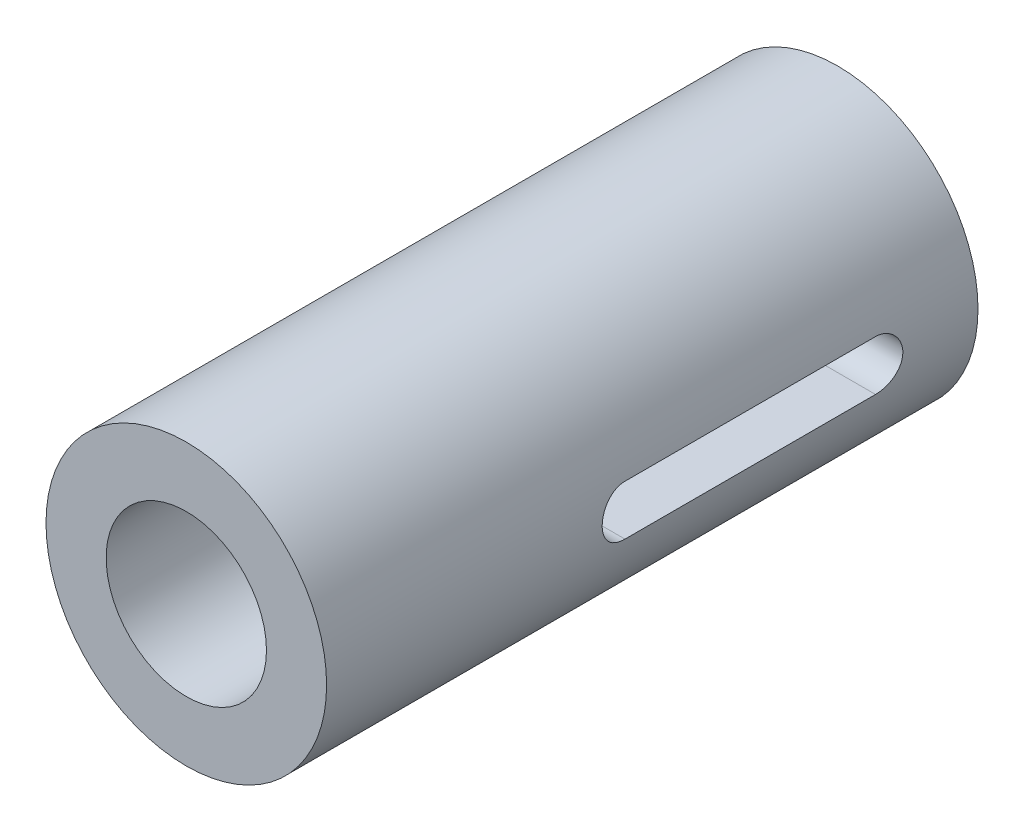
ISO-10303-21;
HEADER;
FILE_DESCRIPTION(('STEP AP214'),'2;1');
FILE_NAME('part.step','',(''),(''),'','','');
FILE_SCHEMA(('AUTOMOTIVE_DESIGN { 1 0 10303 214 1 1 1 1 }'));
ENDSEC;
DATA;
#1=APPLICATION_CONTEXT('core data for automotive mechanical design processes');
#2=APPLICATION_PROTOCOL_DEFINITION('international standard','automotive_design',2000,#1);
#3=PRODUCT_CONTEXT('',#1,'mechanical');
#4=PRODUCT('Part','Part','',(#3));
#5=PRODUCT_RELATED_PRODUCT_CATEGORY('part','',(#4));
#6=PRODUCT_DEFINITION_FORMATION('','',#4);
#7=PRODUCT_DEFINITION_CONTEXT('part definition',#1,'design');
#8=PRODUCT_DEFINITION('design','',#6,#7);
#9=PRODUCT_DEFINITION_SHAPE('','',#8);
#10=(LENGTH_UNIT() NAMED_UNIT(*) SI_UNIT(.MILLI.,.METRE.));
#11=(NAMED_UNIT(*) PLANE_ANGLE_UNIT() SI_UNIT($,.RADIAN.));
#12=(NAMED_UNIT(*) SI_UNIT($,.STERADIAN.) SOLID_ANGLE_UNIT());
#13=UNCERTAINTY_MEASURE_WITH_UNIT(LENGTH_MEASURE(1.E-05),#10,'distance_accuracy_value','');
#14=(GEOMETRIC_REPRESENTATION_CONTEXT(3) GLOBAL_UNCERTAINTY_ASSIGNED_CONTEXT((#13)) GLOBAL_UNIT_ASSIGNED_CONTEXT((#10,
#11,#12)) REPRESENTATION_CONTEXT('',''));
#15=CARTESIAN_POINT('',(0.,0.,0.));
#16=DIRECTION('',(0.,0.,1.));
#17=DIRECTION('',(1.,0.,0.));
#18=AXIS2_PLACEMENT_3D('',#15,#16,#17);
#19=CARTESIAN_POINT('',(0.,0.,20.));
#20=DIRECTION('',(0.,0.,1.));
#21=DIRECTION('',(1.,0.,0.));
#22=AXIS2_PLACEMENT_3D('',#19,#20,#21);
#23=PLANE('',#22);
#24=CARTESIAN_POINT('',(0.,0.,20.));
#25=DIRECTION('',(0.,0.,1.));
#26=DIRECTION('',(1.,0.,0.));
#27=AXIS2_PLACEMENT_3D('',#24,#25,#26);
#28=CIRCLE('',#27,14.);
#29=CARTESIAN_POINT('',(14.,0.,20.));
#30=VERTEX_POINT('',#29);
#31=EDGE_CURVE('E11',#30,#30,#28,.T.);
#32=ORIENTED_EDGE('',*,*,#31,.T.);
#33=EDGE_LOOP('',(#32));
#34=FACE_BOUND('',#33,.T.);
#35=CARTESIAN_POINT('',(0.,0.,20.));
#36=DIRECTION('',(0.,0.,1.));
#37=DIRECTION('',(1.,0.,0.));
#38=AXIS2_PLACEMENT_3D('',#35,#36,#37);
#39=CIRCLE('',#38,8.);
#40=CARTESIAN_POINT('',(8.,0.,20.));
#41=VERTEX_POINT('',#40);
#42=EDGE_CURVE('E43',#41,#41,#39,.T.);
#43=ORIENTED_EDGE('',*,*,#42,.F.);
#44=EDGE_LOOP('',(#43));
#45=FACE_BOUND('',#44,.T.);
#46=ADVANCED_FACE('F33',(#34,#45),#23,.T.);
#47=CARTESIAN_POINT('',(0.,0.,20.));
#48=DIRECTION('',(0.,0.,-1.));
#49=DIRECTION('',(-1.,0.,0.));
#50=AXIS2_PLACEMENT_3D('',#47,#48,#49);
#51=CYLINDRICAL_SURFACE('',#50,14.);
#52=ORIENTED_EDGE('',*,*,#31,.F.);
#53=EDGE_LOOP('',(#52));
#54=FACE_BOUND('',#53,.T.);
#55=CARTESIAN_POINT('',(13.7749773139559,2.5,-35.));
#56=CARTESIAN_POINT('',(13.7749719809296,2.50000738764013,-35.0697169763891));
#57=CARTESIAN_POINT('',(13.7755064686126,2.49708379952609,-35.1394299836275));
#58=CARTESIAN_POINT('',(13.7776156199531,2.48543194862783,-35.2783460586158));
#59=CARTESIAN_POINT('',(13.7791901712834,2.47670431268211,-35.3475491806174));
#60=CARTESIAN_POINT('',(13.7833371889652,2.45351733904257,-35.4848656637306));
#61=CARTESIAN_POINT('',(13.7859083003202,2.43906578343079,-35.552980374347));
#62=CARTESIAN_POINT('',(13.7919690736665,2.40455678108637,-35.6877131625552));
#63=CARTESIAN_POINT('',(13.7954587362955,2.38449933046213,-35.754331239108));
#64=CARTESIAN_POINT('',(13.8071650611379,2.31610983938096,-35.9512638683339));
#65=CARTESIAN_POINT('',(13.8166222423246,2.25954393551424,-36.0787551465722));
#66=CARTESIAN_POINT('',(13.8377703697602,2.1261794089279,-36.322375992879));
#67=CARTESIAN_POINT('',(13.8494614133751,2.04937990424301,-36.438505065376));
#68=CARTESIAN_POINT('',(13.8739070876189,1.87679372046628,-36.6574862673319));
#69=CARTESIAN_POINT('',(13.8866711889081,1.78082476766973,-36.7601939412292));
#70=CARTESIAN_POINT('',(13.9117419356394,1.5730129968333,-36.9481442649627));
#71=CARTESIAN_POINT('',(13.9240485105008,1.46116774233885,-37.0333842292034));
#72=CARTESIAN_POINT('',(13.9469182244891,1.2238301381861,-37.1845284356395));
#73=CARTESIAN_POINT('',(13.9574688089978,1.09824933464104,-37.2502958571518));
#74=CARTESIAN_POINT('',(13.9755305273601,0.837609153747326,-37.3597423112311));
#75=CARTESIAN_POINT('',(13.9830420580298,0.702551016579658,-37.4034242277384));
#76=CARTESIAN_POINT('',(13.9941127098686,0.428295296415084,-37.4670160859913));
#77=CARTESIAN_POINT('',(13.9977126887221,0.289156409172725,-37.4871719349655));
#78=CARTESIAN_POINT('',(14.0006952858165,0.00942505741935738,-37.5039050137605));
#79=CARTESIAN_POINT('',(14.0000781318459,-0.131167328171354,-37.5004835171114));
#80=CARTESIAN_POINT('',(13.9947279528213,-0.408123452124996,-37.4703481962443));
#81=CARTESIAN_POINT('',(13.9900418154943,-0.544517097478202,-37.4438997074663));
#82=CARTESIAN_POINT('',(13.9771326971639,-0.810897887359583,-37.3688801772777));
#83=CARTESIAN_POINT('',(13.9689096200086,-0.940884857615085,-37.3203085344466));
#84=CARTESIAN_POINT('',(13.9497713810402,-1.19154374905277,-37.2021629989799));
#85=CARTESIAN_POINT('',(13.9388424467598,-1.31216373358648,-37.1324812396413));
#86=CARTESIAN_POINT('',(13.9155041793278,-1.54009397675933,-36.9741750588699));
#87=CARTESIAN_POINT('',(13.9030947617144,-1.64740347531981,-36.8855495564648));
#88=CARTESIAN_POINT('',(13.8779697900194,-1.84722881157461,-36.6904186814418));
#89=CARTESIAN_POINT('',(13.8652523744635,-1.93952008048691,-36.5836834616312));
#90=CARTESIAN_POINT('',(13.8411056813571,-2.10494815362711,-36.3560914789895));
#91=CARTESIAN_POINT('',(13.8296767674756,-2.1780795578111,-36.2352307488537));
#92=CARTESIAN_POINT('',(13.8093973568178,-2.30316821861359,-35.9825200248549));
#93=CARTESIAN_POINT('',(13.8005520408213,-2.35508301250252,-35.8506486230763));
#94=CARTESIAN_POINT('',(13.7865213108275,-2.43588597096069,-35.5799513758876));
#95=CARTESIAN_POINT('',(13.7813304352073,-2.4648085062432,-35.4411362420072));
#96=CARTESIAN_POINT('',(13.7771728371923,-2.48787628027008,-35.2510390104806));
#97=CARTESIAN_POINT('',(13.7763503067211,-2.49242446974386,-35.2008983138401));
#98=CARTESIAN_POINT('',(13.7752530670693,-2.49848241912307,-35.1005124652916));
#99=CARTESIAN_POINT('',(13.7749774372196,-2.49999728545632,-35.0502676317141));
#100=CARTESIAN_POINT('',(13.7749773139559,-2.5,-35.));
#101=B_SPLINE_CURVE_WITH_KNOTS('',3,(#55,#56,#57,#58,#59,#60,#61,#62,#63,#64,#65,#66,#67,#68,
#69,#70,#71,#72,#73,#74,#75,#76,#77,#78,#79,#80,#81,#82,#83,#84,#85,#86,#87,#88,#89,#90,#91,#92,
#93,#94,#95,#96,#97,#98,#99,#100),.UNSPECIFIED.,.F.,.F.,(4,2,2,2,2,2,2,2,2,2,2,2,2,2,2,2,2,2,2,
2,2,2,4),(0.,0.20908063236545,0.418138687640859,0.626913483707531,0.835688424705488,
1.25294270731086,1.67021518068189,2.09166233739034,2.51317424149734,2.93758113507458,
3.36193259498486,3.78180761495385,4.2016599555548,4.61673750871168,5.03182634647342,
5.44907300587891,5.8663434806745,6.28937182366545,6.71251926562592,7.13650949186788,
7.55986470459476,7.71085292872879,7.86158675831534),.UNSPECIFIED.);
#102=CARTESIAN_POINT('',(13.7749773139559,2.5,-35.));
#103=VERTEX_POINT('',#102);
#104=CARTESIAN_POINT('',(13.7749773139559,-2.5,-35.));
#105=VERTEX_POINT('',#104);
#106=EDGE_CURVE('E76',#103,#105,#101,.T.);
#107=ORIENTED_EDGE('',*,*,#106,.T.);
#108=DIRECTION('',(0.,0.,-1.));
#109=VECTOR('',#108,1.);
#110=CARTESIAN_POINT('',(13.7749773139559,-2.5,20.));
#111=LINE('',#110,#109);
#112=CARTESIAN_POINT('',(13.7749773139559,-2.5,-10.));
#113=VERTEX_POINT('',#112);
#114=EDGE_CURVE('E51',#105,#113,#111,.F.);
#115=ORIENTED_EDGE('',*,*,#114,.T.);
#116=CARTESIAN_POINT('',(13.7749773139559,-2.5,-10.));
#117=CARTESIAN_POINT('',(13.7749719809296,-2.50000738764012,-9.93028302361092));
#118=CARTESIAN_POINT('',(13.7755064686126,-2.49708379952609,-9.86057001637249));
#119=CARTESIAN_POINT('',(13.7776156199531,-2.48543194862783,-9.72165394138418));
#120=CARTESIAN_POINT('',(13.7791901712834,-2.47670431268211,-9.65245081938254));
#121=CARTESIAN_POINT('',(13.7833371889652,-2.45351733904257,-9.51513433626941));
#122=CARTESIAN_POINT('',(13.7859083003202,-2.43906578343079,-9.44701962565297));
#123=CARTESIAN_POINT('',(13.7919690736665,-2.40455678108637,-9.31228683744477));
#124=CARTESIAN_POINT('',(13.7954587362955,-2.38449933046213,-9.245668760892));
#125=CARTESIAN_POINT('',(13.8071650611379,-2.31610983938096,-9.0487361316661));
#126=CARTESIAN_POINT('',(13.8166222423246,-2.25954393551424,-8.92124485342779));
#127=CARTESIAN_POINT('',(13.8377703697602,-2.1261794089279,-8.67762400712103));
#128=CARTESIAN_POINT('',(13.8494614133751,-2.04937990424301,-8.56149493462403));
#129=CARTESIAN_POINT('',(13.8739070876189,-1.87679372046628,-8.34251373266811));
#130=CARTESIAN_POINT('',(13.8866711889081,-1.78082476766973,-8.23980605877079));
#131=CARTESIAN_POINT('',(13.9117419356394,-1.5730129968333,-8.05185573503735));
#132=CARTESIAN_POINT('',(13.9240485105008,-1.46116774233884,-7.96661577079659));
#133=CARTESIAN_POINT('',(13.9469182244891,-1.22383013818609,-7.81547156436051));
#134=CARTESIAN_POINT('',(13.9574688089978,-1.09824933464104,-7.74970414284816));
#135=CARTESIAN_POINT('',(13.9755305273601,-0.837609153747323,-7.64025768876895));
#136=CARTESIAN_POINT('',(13.9830420580298,-0.702551016579657,-7.59657577226164));
#137=CARTESIAN_POINT('',(13.9941127098686,-0.428295296415084,-7.53298391400871));
#138=CARTESIAN_POINT('',(13.9977126887221,-0.289156409172724,-7.51282806503446));
#139=CARTESIAN_POINT('',(14.0006952858165,-0.0094250574193551,-7.49609498623949));
#140=CARTESIAN_POINT('',(14.0000781318459,0.131167328171357,-7.49951648288864));
#141=CARTESIAN_POINT('',(13.9947279528213,0.408123452125,-7.52965180375569));
#142=CARTESIAN_POINT('',(13.9900418154943,0.544517097478206,-7.5561002925337));
#143=CARTESIAN_POINT('',(13.9771326971639,0.810897887359586,-7.63111982272229));
#144=CARTESIAN_POINT('',(13.9689096200086,0.940884857615087,-7.67969146555338));
#145=CARTESIAN_POINT('',(13.9497713810402,1.19154374905277,-7.79783700102011));
#146=CARTESIAN_POINT('',(13.9388424467598,1.31216373358649,-7.86751876035875));
#147=CARTESIAN_POINT('',(13.9155041793278,1.54009397675933,-8.02582494113006));
#148=CARTESIAN_POINT('',(13.9030947617144,1.64740347531982,-8.11445044353525));
#149=CARTESIAN_POINT('',(13.8779697900194,1.84722881157461,-8.30958131855824));
#150=CARTESIAN_POINT('',(13.8652523744635,1.93952008048691,-8.41631653836878));
#151=CARTESIAN_POINT('',(13.8411056813571,2.10494815362711,-8.64390852101052));
#152=CARTESIAN_POINT('',(13.8296767674756,2.1780795578111,-8.76476925114632));
#153=CARTESIAN_POINT('',(13.8093973568178,2.30316821861359,-9.01747997514507));
#154=CARTESIAN_POINT('',(13.8005520408213,2.35508301250252,-9.14935137692371));
#155=CARTESIAN_POINT('',(13.7865213108275,2.43588597096069,-9.42004862411245));
#156=CARTESIAN_POINT('',(13.7813304352073,2.46480850624321,-9.55886375799276));
#157=CARTESIAN_POINT('',(13.7771728371923,2.48787628027008,-9.74896098951946));
#158=CARTESIAN_POINT('',(13.7763503067211,2.49242446974386,-9.79910168615988));
#159=CARTESIAN_POINT('',(13.7752530670693,2.49848241912307,-9.89948753470838));
#160=CARTESIAN_POINT('',(13.7749774372196,2.49999728545632,-9.94973236828592));
#161=CARTESIAN_POINT('',(13.7749773139559,2.5,-10.));
#162=B_SPLINE_CURVE_WITH_KNOTS('',3,(#116,#117,#118,#119,#120,#121,#122,#123,#124,#125,#126,
#127,#128,#129,#130,#131,#132,#133,#134,#135,#136,#137,#138,#139,#140,#141,#142,#143,#144,#145,
#146,#147,#148,#149,#150,#151,#152,#153,#154,#155,#156,#157,#158,#159,#160,#161),.UNSPECIFIED.,
.F.,.F.,(4,2,2,2,2,2,2,2,2,2,2,2,2,2,2,2,2,2,2,2,2,2,4),(0.,0.209080632365448,0.418138687640871,
0.62691348370754,0.835688424705489,1.25294270731087,1.67021518068189,2.09166233739034,
2.51317424149734,2.93758113507459,3.36193259498486,3.78180761495385,4.2016599555548,
4.61673750871168,5.03182634647342,5.44907300587891,5.8663434806745,6.28937182366545,
6.71251926562592,7.13650949186788,7.55986470459477,7.7108529287288,7.86158675831533),.UNSPECIFIED.);
#163=CARTESIAN_POINT('',(13.7749773139559,2.5,-10.));
#164=VERTEX_POINT('',#163);
#165=EDGE_CURVE('E80',#113,#164,#162,.T.);
#166=ORIENTED_EDGE('',*,*,#165,.T.);
#167=DIRECTION('',(0.,0.,-1.));
#168=VECTOR('',#167,1.);
#169=CARTESIAN_POINT('',(13.7749773139559,2.5,20.));
#170=LINE('',#169,#168);
#171=EDGE_CURVE('E108',#164,#103,#170,.T.);
#172=ORIENTED_EDGE('',*,*,#171,.T.);
#173=EDGE_LOOP('',(#107,#115,#166,#172));
#174=FACE_BOUND('',#173,.T.);
#175=CARTESIAN_POINT('',(0.,0.,-45.));
#176=DIRECTION('',(0.,0.,1.));
#177=DIRECTION('',(1.,0.,0.));
#178=AXIS2_PLACEMENT_3D('',#175,#176,#177);
#179=CIRCLE('',#178,14.);
#180=CARTESIAN_POINT('',(14.,0.,-45.));
#181=VERTEX_POINT('',#180);
#182=EDGE_CURVE('E129',#181,#181,#179,.F.);
#183=ORIENTED_EDGE('',*,*,#182,.F.);
#184=EDGE_LOOP('',(#183));
#185=FACE_BOUND('',#184,.T.);
#186=DIRECTION('',(0.,0.,-1.));
#187=VECTOR('',#186,1.);
#188=CARTESIAN_POINT('',(-13.7749773139559,2.5,20.));
#189=LINE('',#188,#187);
#190=CARTESIAN_POINT('',(-13.7749773139559,2.5,-10.));
#191=VERTEX_POINT('',#190);
#192=CARTESIAN_POINT('',(-13.7749773139559,2.5,-35.));
#193=VERTEX_POINT('',#192);
#194=EDGE_CURVE('E87',#191,#193,#189,.T.);
#195=ORIENTED_EDGE('',*,*,#194,.F.);
#196=CARTESIAN_POINT('',(-13.7749773139559,-2.5,-10.));
#197=CARTESIAN_POINT('',(-13.7749719809296,-2.50000738764012,-9.93028302361092));
#198=CARTESIAN_POINT('',(-13.7755064686126,-2.49708379952609,-9.86057001637249));
#199=CARTESIAN_POINT('',(-13.7776156199531,-2.48543194862783,-9.72165394138418));
#200=CARTESIAN_POINT('',(-13.7791901712834,-2.47670431268211,-9.65245081938254));
#201=CARTESIAN_POINT('',(-13.7833371889652,-2.45351733904257,-9.51513433626941));
#202=CARTESIAN_POINT('',(-13.7859083003202,-2.43906578343079,-9.44701962565297));
#203=CARTESIAN_POINT('',(-13.7919690736665,-2.40455678108637,-9.31228683744477));
#204=CARTESIAN_POINT('',(-13.7954587362955,-2.38449933046213,-9.245668760892));
#205=CARTESIAN_POINT('',(-13.8071650611379,-2.31610983938096,-9.0487361316661));
#206=CARTESIAN_POINT('',(-13.8166222423246,-2.25954393551424,-8.92124485342779));
#207=CARTESIAN_POINT('',(-13.8377703697602,-2.1261794089279,-8.67762400712103));
#208=CARTESIAN_POINT('',(-13.8494614133751,-2.04937990424301,-8.56149493462403));
#209=CARTESIAN_POINT('',(-13.8739070876189,-1.87679372046628,-8.34251373266811));
#210=CARTESIAN_POINT('',(-13.8866711889081,-1.78082476766973,-8.23980605877079));
#211=CARTESIAN_POINT('',(-13.9117419356394,-1.5730129968333,-8.05185573503735));
#212=CARTESIAN_POINT('',(-13.9240485105008,-1.46116774233884,-7.96661577079659));
#213=CARTESIAN_POINT('',(-13.9469182244891,-1.22383013818609,-7.81547156436051));
#214=CARTESIAN_POINT('',(-13.9574688089978,-1.09824933464104,-7.74970414284816));
#215=CARTESIAN_POINT('',(-13.9755305273601,-0.837609153747323,-7.64025768876895));
#216=CARTESIAN_POINT('',(-13.9830420580298,-0.702551016579657,-7.59657577226164));
#217=CARTESIAN_POINT('',(-13.9941127098686,-0.428295296415084,-7.53298391400871));
#218=CARTESIAN_POINT('',(-13.9977126887221,-0.289156409172724,-7.51282806503446));
#219=CARTESIAN_POINT('',(-14.0006952858165,-0.0094250574193551,-7.49609498623949));
#220=CARTESIAN_POINT('',(-14.0000781318459,0.131167328171357,-7.49951648288864));
#221=CARTESIAN_POINT('',(-13.9947279528213,0.408123452125,-7.52965180375569));
#222=CARTESIAN_POINT('',(-13.9900418154943,0.544517097478206,-7.5561002925337));
#223=CARTESIAN_POINT('',(-13.9771326971639,0.810897887359586,-7.63111982272229));
#224=CARTESIAN_POINT('',(-13.9689096200086,0.940884857615087,-7.67969146555338));
#225=CARTESIAN_POINT('',(-13.9497713810402,1.19154374905277,-7.79783700102011));
#226=CARTESIAN_POINT('',(-13.9388424467598,1.31216373358649,-7.86751876035875));
#227=CARTESIAN_POINT('',(-13.9155041793278,1.54009397675933,-8.02582494113006));
#228=CARTESIAN_POINT('',(-13.9030947617144,1.64740347531982,-8.11445044353525));
#229=CARTESIAN_POINT('',(-13.8779697900194,1.84722881157461,-8.30958131855824));
#230=CARTESIAN_POINT('',(-13.8652523744635,1.93952008048691,-8.41631653836878));
#231=CARTESIAN_POINT('',(-13.8411056813571,2.10494815362711,-8.64390852101052));
#232=CARTESIAN_POINT('',(-13.8296767674756,2.1780795578111,-8.76476925114632));
#233=CARTESIAN_POINT('',(-13.8093973568178,2.30316821861359,-9.01747997514507));
#234=CARTESIAN_POINT('',(-13.8005520408213,2.35508301250252,-9.14935137692371));
#235=CARTESIAN_POINT('',(-13.7865213108275,2.43588597096069,-9.42004862411245));
#236=CARTESIAN_POINT('',(-13.7813304352073,2.46480850624321,-9.55886375799276));
#237=CARTESIAN_POINT('',(-13.7771728371923,2.48787628027008,-9.74896098951946));
#238=CARTESIAN_POINT('',(-13.7763503067211,2.49242446974386,-9.79910168615988));
#239=CARTESIAN_POINT('',(-13.7752530670693,2.49848241912307,-9.89948753470838));
#240=CARTESIAN_POINT('',(-13.7749774372196,2.49999728545632,-9.94973236828592));
#241=CARTESIAN_POINT('',(-13.7749773139559,2.5,-10.));
#242=B_SPLINE_CURVE_WITH_KNOTS('',3,(#196,#197,#198,#199,#200,#201,#202,#203,#204,#205,#206,
#207,#208,#209,#210,#211,#212,#213,#214,#215,#216,#217,#218,#219,#220,#221,#222,#223,#224,#225,
#226,#227,#228,#229,#230,#231,#232,#233,#234,#235,#236,#237,#238,#239,#240,#241),.UNSPECIFIED.,
.F.,.F.,(4,2,2,2,2,2,2,2,2,2,2,2,2,2,2,2,2,2,2,2,2,2,4),(0.,0.209080632365448,0.418138687640871,
0.62691348370754,0.835688424705489,1.25294270731087,1.67021518068189,2.09166233739034,
2.51317424149734,2.93758113507459,3.36193259498486,3.78180761495385,4.2016599555548,
4.61673750871168,5.03182634647342,5.44907300587891,5.8663434806745,6.28937182366545,
6.71251926562592,7.13650949186788,7.55986470459477,7.7108529287288,7.86158675831533),.UNSPECIFIED.);
#243=CARTESIAN_POINT('',(-13.7749773139559,-2.5,-10.));
#244=VERTEX_POINT('',#243);
#245=EDGE_CURVE('E135',#244,#191,#242,.T.);
#246=ORIENTED_EDGE('',*,*,#245,.F.);
#247=DIRECTION('',(0.,0.,-1.));
#248=VECTOR('',#247,1.);
#249=CARTESIAN_POINT('',(-13.7749773139559,-2.5,20.));
#250=LINE('',#249,#248);
#251=CARTESIAN_POINT('',(-13.7749773139559,-2.5,-35.));
#252=VERTEX_POINT('',#251);
#253=EDGE_CURVE('E90',#252,#244,#250,.F.);
#254=ORIENTED_EDGE('',*,*,#253,.F.);
#255=CARTESIAN_POINT('',(-13.7749773139559,2.5,-35.));
#256=CARTESIAN_POINT('',(-13.7749719809296,2.50000738764013,-35.0697169763891));
#257=CARTESIAN_POINT('',(-13.7755064686126,2.49708379952609,-35.1394299836275));
#258=CARTESIAN_POINT('',(-13.7776156199531,2.48543194862783,-35.2783460586158));
#259=CARTESIAN_POINT('',(-13.7791901712834,2.47670431268211,-35.3475491806174));
#260=CARTESIAN_POINT('',(-13.7833371889652,2.45351733904257,-35.4848656637306));
#261=CARTESIAN_POINT('',(-13.7859083003202,2.43906578343079,-35.552980374347));
#262=CARTESIAN_POINT('',(-13.7919690736665,2.40455678108637,-35.6877131625552));
#263=CARTESIAN_POINT('',(-13.7954587362955,2.38449933046213,-35.754331239108));
#264=CARTESIAN_POINT('',(-13.8071650611379,2.31610983938096,-35.9512638683339));
#265=CARTESIAN_POINT('',(-13.8166222423246,2.25954393551424,-36.0787551465722));
#266=CARTESIAN_POINT('',(-13.8377703697602,2.1261794089279,-36.322375992879));
#267=CARTESIAN_POINT('',(-13.8494614133751,2.04937990424301,-36.438505065376));
#268=CARTESIAN_POINT('',(-13.8739070876189,1.87679372046628,-36.6574862673319));
#269=CARTESIAN_POINT('',(-13.8866711889081,1.78082476766973,-36.7601939412292));
#270=CARTESIAN_POINT('',(-13.9117419356394,1.5730129968333,-36.9481442649627));
#271=CARTESIAN_POINT('',(-13.9240485105008,1.46116774233885,-37.0333842292034));
#272=CARTESIAN_POINT('',(-13.9469182244891,1.2238301381861,-37.1845284356395));
#273=CARTESIAN_POINT('',(-13.9574688089978,1.09824933464104,-37.2502958571518));
#274=CARTESIAN_POINT('',(-13.9755305273601,0.837609153747326,-37.3597423112311));
#275=CARTESIAN_POINT('',(-13.9830420580298,0.702551016579658,-37.4034242277384));
#276=CARTESIAN_POINT('',(-13.9941127098686,0.428295296415084,-37.4670160859913));
#277=CARTESIAN_POINT('',(-13.9977126887221,0.289156409172725,-37.4871719349655));
#278=CARTESIAN_POINT('',(-14.0006952858165,0.00942505741935738,-37.5039050137605));
#279=CARTESIAN_POINT('',(-14.0000781318459,-0.131167328171354,-37.5004835171114));
#280=CARTESIAN_POINT('',(-13.9947279528213,-0.408123452124996,-37.4703481962443));
#281=CARTESIAN_POINT('',(-13.9900418154943,-0.544517097478202,-37.4438997074663));
#282=CARTESIAN_POINT('',(-13.9771326971639,-0.810897887359583,-37.3688801772777));
#283=CARTESIAN_POINT('',(-13.9689096200086,-0.940884857615085,-37.3203085344466));
#284=CARTESIAN_POINT('',(-13.9497713810402,-1.19154374905277,-37.2021629989799));
#285=CARTESIAN_POINT('',(-13.9388424467598,-1.31216373358648,-37.1324812396413));
#286=CARTESIAN_POINT('',(-13.9155041793278,-1.54009397675933,-36.9741750588699));
#287=CARTESIAN_POINT('',(-13.9030947617144,-1.64740347531981,-36.8855495564648));
#288=CARTESIAN_POINT('',(-13.8779697900194,-1.84722881157461,-36.6904186814418));
#289=CARTESIAN_POINT('',(-13.8652523744635,-1.93952008048691,-36.5836834616312));
#290=CARTESIAN_POINT('',(-13.8411056813571,-2.10494815362711,-36.3560914789895));
#291=CARTESIAN_POINT('',(-13.8296767674756,-2.1780795578111,-36.2352307488537));
#292=CARTESIAN_POINT('',(-13.8093973568178,-2.30316821861359,-35.9825200248549));
#293=CARTESIAN_POINT('',(-13.8005520408213,-2.35508301250252,-35.8506486230763));
#294=CARTESIAN_POINT('',(-13.7865213108275,-2.43588597096069,-35.5799513758876));
#295=CARTESIAN_POINT('',(-13.7813304352073,-2.4648085062432,-35.4411362420072));
#296=CARTESIAN_POINT('',(-13.7771728371923,-2.48787628027008,-35.2510390104806));
#297=CARTESIAN_POINT('',(-13.7763503067211,-2.49242446974386,-35.2008983138401));
#298=CARTESIAN_POINT('',(-13.7752530670693,-2.49848241912307,-35.1005124652916));
#299=CARTESIAN_POINT('',(-13.7749774372196,-2.49999728545632,-35.0502676317141));
#300=CARTESIAN_POINT('',(-13.7749773139559,-2.5,-35.));
#301=B_SPLINE_CURVE_WITH_KNOTS('',3,(#255,#256,#257,#258,#259,#260,#261,#262,#263,#264,#265,
#266,#267,#268,#269,#270,#271,#272,#273,#274,#275,#276,#277,#278,#279,#280,#281,#282,#283,#284,
#285,#286,#287,#288,#289,#290,#291,#292,#293,#294,#295,#296,#297,#298,#299,#300),.UNSPECIFIED.,
.F.,.F.,(4,2,2,2,2,2,2,2,2,2,2,2,2,2,2,2,2,2,2,2,2,2,4),(0.,0.20908063236545,0.418138687640859,
0.626913483707531,0.835688424705488,1.25294270731086,1.67021518068189,2.09166233739034,
2.51317424149734,2.93758113507458,3.36193259498486,3.78180761495385,4.2016599555548,
4.61673750871168,5.03182634647342,5.44907300587891,5.8663434806745,6.28937182366545,
6.71251926562592,7.13650949186788,7.55986470459476,7.71085292872879,7.86158675831534),.UNSPECIFIED.);
#302=EDGE_CURVE('E75',#193,#252,#301,.T.);
#303=ORIENTED_EDGE('',*,*,#302,.F.);
#304=EDGE_LOOP('',(#195,#246,#254,#303));
#305=FACE_BOUND('',#304,.T.);
#306=ADVANCED_FACE('F35',(#54,#174,#185,#305),#51,.T.);
#307=CARTESIAN_POINT('',(0.,0.,20.));
#308=DIRECTION('',(0.,0.,-1.));
#309=DIRECTION('',(-1.,0.,0.));
#310=AXIS2_PLACEMENT_3D('',#307,#308,#309);
#311=CYLINDRICAL_SURFACE('',#310,8.);
#312=ORIENTED_EDGE('',*,*,#42,.T.);
#313=EDGE_LOOP('',(#312));
#314=FACE_BOUND('',#313,.T.);
#315=CARTESIAN_POINT('',(0.,0.,0.));
#316=DIRECTION('',(0.,0.,1.));
#317=DIRECTION('',(1.,0.,0.));
#318=AXIS2_PLACEMENT_3D('',#315,#316,#317);
#319=CIRCLE('',#318,8.);
#320=CARTESIAN_POINT('',(8.,0.,0.));
#321=VERTEX_POINT('',#320);
#322=EDGE_CURVE('E139',#321,#321,#319,.T.);
#323=ORIENTED_EDGE('',*,*,#322,.F.);
#324=EDGE_LOOP('',(#323));
#325=FACE_BOUND('',#324,.T.);
#326=ADVANCED_FACE('F146',(#314,#325),#311,.F.);
#327=CARTESIAN_POINT('',(14.001,-14.,0.));
#328=DIRECTION('',(0.,0.,-1.));
#329=DIRECTION('',(0.,1.,0.));
#330=AXIS2_PLACEMENT_3D('',#327,#328,#329);
#331=PLANE('',#330);
#332=ORIENTED_EDGE('',*,*,#322,.T.);
#333=EDGE_LOOP('',(#332));
#334=FACE_BOUND('',#333,.T.);
#335=ADVANCED_FACE('F144',(#334),#331,.F.);
#336=CARTESIAN_POINT('',(14.001,-2.5,-35.));
#337=DIRECTION('',(0.,1.,0.));
#338=DIRECTION('',(0.,0.,1.));
#339=AXIS2_PLACEMENT_3D('',#336,#337,#338);
#340=PLANE('',#339);
#341=ORIENTED_EDGE('',*,*,#114,.F.);
#342=DIRECTION('',(-1.,0.,0.));
#343=VECTOR('',#342,1.);
#344=CARTESIAN_POINT('',(14.001,-2.5,-35.));
#345=LINE('',#344,#343);
#346=EDGE_CURVE('E132',#105,#252,#345,.T.);
#347=ORIENTED_EDGE('',*,*,#346,.T.);
#348=ORIENTED_EDGE('',*,*,#253,.T.);
#349=DIRECTION('',(-1.,0.,0.));
#350=VECTOR('',#349,1.);
#351=CARTESIAN_POINT('',(14.001,-2.5,-10.));
#352=LINE('',#351,#350);
#353=EDGE_CURVE('E134',#113,#244,#352,.T.);
#354=ORIENTED_EDGE('',*,*,#353,.F.);
#355=EDGE_LOOP('',(#341,#347,#348,#354));
#356=FACE_BOUND('',#355,.T.);
#357=ADVANCED_FACE('F115',(#356),#340,.T.);
#358=CARTESIAN_POINT('',(14.001,0.,-10.));
#359=DIRECTION('',(-1.,0.,0.));
#360=DIRECTION('',(0.,0.,1.));
#361=AXIS2_PLACEMENT_3D('',#358,#359,#360);
#362=CYLINDRICAL_SURFACE('',#361,2.5);
#363=ORIENTED_EDGE('',*,*,#165,.F.);
#364=ORIENTED_EDGE('',*,*,#353,.T.);
#365=ORIENTED_EDGE('',*,*,#245,.T.);
#366=DIRECTION('',(-1.,0.,0.));
#367=VECTOR('',#366,1.);
#368=CARTESIAN_POINT('',(14.001,2.5,-10.));
#369=LINE('',#368,#367);
#370=EDGE_CURVE('E81',#164,#191,#369,.T.);
#371=ORIENTED_EDGE('',*,*,#370,.F.);
#372=EDGE_LOOP('',(#363,#364,#365,#371));
#373=FACE_BOUND('',#372,.T.);
#374=ADVANCED_FACE('F110',(#373),#362,.F.);
#375=CARTESIAN_POINT('',(14.001,2.5,-35.));
#376=DIRECTION('',(0.,-1.,0.));
#377=DIRECTION('',(0.,0.,-1.));
#378=AXIS2_PLACEMENT_3D('',#375,#376,#377);
#379=PLANE('',#378);
#380=ORIENTED_EDGE('',*,*,#171,.F.);
#381=ORIENTED_EDGE('',*,*,#370,.T.);
#382=ORIENTED_EDGE('',*,*,#194,.T.);
#383=DIRECTION('',(-1.,0.,0.));
#384=VECTOR('',#383,1.);
#385=CARTESIAN_POINT('',(14.001,2.5,-35.));
#386=LINE('',#385,#384);
#387=EDGE_CURVE('E71',#103,#193,#386,.T.);
#388=ORIENTED_EDGE('',*,*,#387,.F.);
#389=EDGE_LOOP('',(#380,#381,#382,#388));
#390=FACE_BOUND('',#389,.T.);
#391=ADVANCED_FACE('F92',(#390),#379,.T.);
#392=CARTESIAN_POINT('',(14.001,0.,-35.));
#393=DIRECTION('',(-1.,0.,0.));
#394=DIRECTION('',(0.,0.,1.));
#395=AXIS2_PLACEMENT_3D('',#392,#393,#394);
#396=CYLINDRICAL_SURFACE('',#395,2.5);
#397=ORIENTED_EDGE('',*,*,#106,.F.);
#398=ORIENTED_EDGE('',*,*,#387,.T.);
#399=ORIENTED_EDGE('',*,*,#302,.T.);
#400=ORIENTED_EDGE('',*,*,#346,.F.);
#401=EDGE_LOOP('',(#397,#398,#399,#400));
#402=FACE_BOUND('',#401,.T.);
#403=ADVANCED_FACE('F73',(#402),#396,.F.);
#404=CARTESIAN_POINT('',(14.001,-14.,-45.));
#405=DIRECTION('',(0.,0.,1.));
#406=DIRECTION('',(1.,0.,0.));
#407=AXIS2_PLACEMENT_3D('',#404,#405,#406);
#408=PLANE('',#407);
#409=ORIENTED_EDGE('',*,*,#182,.T.);
#410=EDGE_LOOP('',(#409));
#411=FACE_BOUND('',#410,.T.);
#412=ADVANCED_FACE('F122',(#411),#408,.F.);
#413=CLOSED_SHELL('',(#46,#306,#326,#335,#357,#374,#391,#403,#412));
#414=MANIFOLD_SOLID_BREP('B2',#413);
#415=ADVANCED_BREP_SHAPE_REPRESENTATION('',(#18,#414),#14);
#416=SHAPE_DEFINITION_REPRESENTATION(#9,#415);
ENDSEC;
END-ISO-10303-21;
